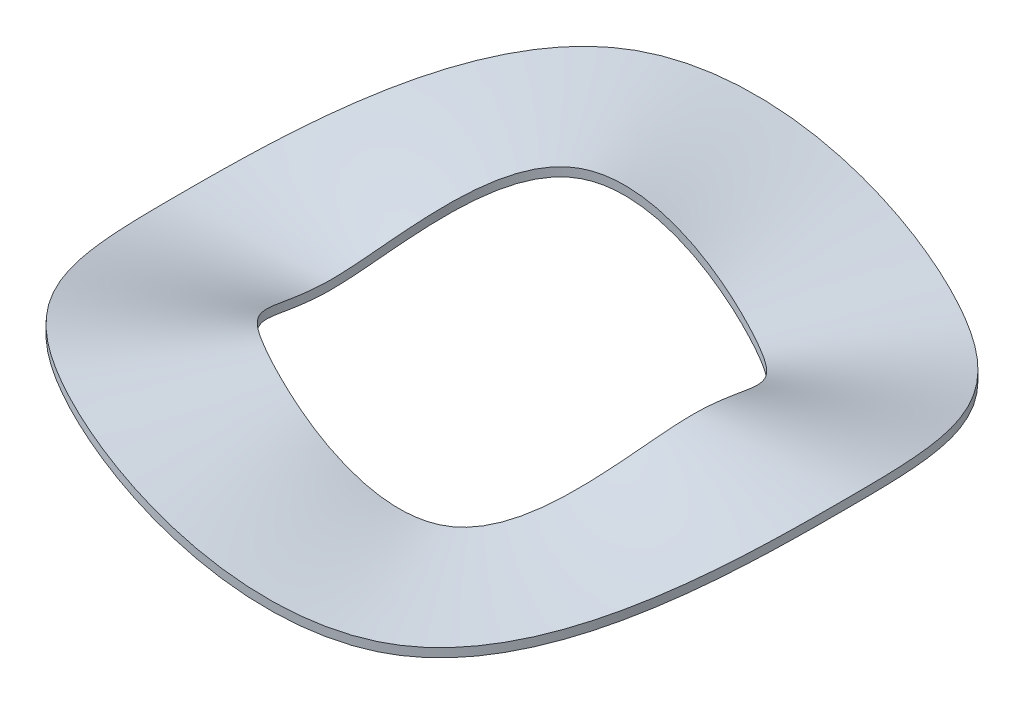
ISO-10303-21;
HEADER;
FILE_DESCRIPTION(('STEP AP214'),'2;1');
FILE_NAME('part.step','',(''),(''),'','','');
FILE_SCHEMA(('AUTOMOTIVE_DESIGN { 1 0 10303 214 1 1 1 1 }'));
ENDSEC;
DATA;
#1=APPLICATION_CONTEXT('core data for automotive mechanical design processes');
#2=APPLICATION_PROTOCOL_DEFINITION('international standard','automotive_design',2000,#1);
#3=PRODUCT_CONTEXT('',#1,'mechanical');
#4=PRODUCT('Part','Part','',(#3));
#5=PRODUCT_RELATED_PRODUCT_CATEGORY('part','',(#4));
#6=PRODUCT_DEFINITION_FORMATION('','',#4);
#7=PRODUCT_DEFINITION_CONTEXT('part definition',#1,'design');
#8=PRODUCT_DEFINITION('design','',#6,#7);
#9=PRODUCT_DEFINITION_SHAPE('','',#8);
#10=(LENGTH_UNIT() NAMED_UNIT(*) SI_UNIT(.MILLI.,.METRE.));
#11=(NAMED_UNIT(*) PLANE_ANGLE_UNIT() SI_UNIT($,.RADIAN.));
#12=(NAMED_UNIT(*) SI_UNIT($,.STERADIAN.) SOLID_ANGLE_UNIT());
#13=UNCERTAINTY_MEASURE_WITH_UNIT(LENGTH_MEASURE(1.E-05),#10,'distance_accuracy_value','');
#14=(GEOMETRIC_REPRESENTATION_CONTEXT(3) GLOBAL_UNCERTAINTY_ASSIGNED_CONTEXT((#13)) GLOBAL_UNIT_ASSIGNED_CONTEXT((#10,
#11,#12)) REPRESENTATION_CONTEXT('',''));
#15=CARTESIAN_POINT('',(0.,0.,0.));
#16=DIRECTION('',(0.,0.,1.));
#17=DIRECTION('',(1.,0.,0.));
#18=AXIS2_PLACEMENT_3D('',#15,#16,#17);
#19=CARTESIAN_POINT('',(-4.7625,0.127,0.));
#20=CARTESIAN_POINT('',(-4.76250000000064,0.127000000000109,-0.0824889197101102));
#21=CARTESIAN_POINT('',(-4.75773750000184,0.1315720000003,-0.247466759130352));
#22=CARTESIAN_POINT('',(-4.73666343750347,0.15077440000051,-0.494314851362952));
#23=CARTESIAN_POINT('',(-4.70201625000492,0.180949600000651,-0.739925609799963));
#24=CARTESIAN_POINT('',(-4.41483750001165,0.419608000001919,-2.20245415626632));
#25=CARTESIAN_POINT('',(-2.47650000000634,1.77292000000034,-4.94933518262082));
#26=CARTESIAN_POINT('',(2.85749999997695,-0.787399999999908,-4.94933518262991));
#27=CARTESIAN_POINT('',(5.7150000000307,1.95579999998627,-5.46359358037825E-11));
#28=CARTESIAN_POINT('',(2.85749999984022,-0.787400000002771,4.94933518271295));
#29=CARTESIAN_POINT('',(-2.47649999992121,1.77292000001231,4.94933518265687));
#30=CARTESIAN_POINT('',(-4.41483749998004,0.419607999995685,2.20245415625955));
#31=CARTESIAN_POINT('',(-4.70201624999364,0.180949599998723,0.73992560979949));
#32=CARTESIAN_POINT('',(-4.73666343749587,0.150774399999208,0.494314851362734));
#33=CARTESIAN_POINT('',(-4.75773749999802,0.131571999999644,0.247466759130307));
#34=CARTESIAN_POINT('',(-4.76249999999936,0.126999999999891,0.0824889197101086));
#35=CARTESIAN_POINT('',(-4.7625,0.127,0.));
#36=CARTESIAN_POINT('',(-4.04283333333333,0.127,0.));
#37=CARTESIAN_POINT('',(-4.04283333333387,0.127000000000109,-0.0700239273983604));
#38=CARTESIAN_POINT('',(-4.03879050000157,0.1315720000003,-0.210071782195099));
#39=CARTESIAN_POINT('',(-4.02090096250294,0.15077440000051,-0.419618384934773));
#40=CARTESIAN_POINT('',(-3.99148935000417,0.180949600000651,-0.628114628763524));
#41=CARTESIAN_POINT('',(-3.74770650000989,0.419608000001919,-1.86963886154163));
#42=CARTESIAN_POINT('',(-2.10227333333872,1.77292000000034,-4.20143564391368));
#43=CARTESIAN_POINT('',(2.42569999998044,-0.787399999999908,-4.20143564392139));
#44=CARTESIAN_POINT('',(4.85140000002606,1.95579999998627,-4.63798074110729E-11));
#45=CARTESIAN_POINT('',(2.42569999986436,-0.787400000002771,4.20143564399188));
#46=CARTESIAN_POINT('',(-2.10227333326645,1.77292000001231,4.20143564394428));
#47=CARTESIAN_POINT('',(-3.74770649998306,0.419607999995685,1.86963886153589));
#48=CARTESIAN_POINT('',(-3.9914893499946,0.180949599998723,0.628114628763123));
#49=CARTESIAN_POINT('',(-4.02090096249649,0.150774399999208,0.419618384934587));
#50=CARTESIAN_POINT('',(-4.03879049999832,0.131571999999644,0.21007178219506));
#51=CARTESIAN_POINT('',(-4.04283333333279,0.126999999999891,0.0700239273983587));
#52=CARTESIAN_POINT('',(-4.04283333333333,0.127,0.));
#53=CARTESIAN_POINT('',(-3.32316666666667,0.127,0.));
#54=CARTESIAN_POINT('',(-3.32316666666711,0.127000000000109,-0.0575589350866104));
#55=CARTESIAN_POINT('',(-3.31984350000129,0.1315720000003,-0.172676805259846));
#56=CARTESIAN_POINT('',(-3.30513848750242,0.15077440000051,-0.344921918506593));
#57=CARTESIAN_POINT('',(-3.28096245000343,0.180949600000651,-0.516303647727085));
#58=CARTESIAN_POINT('',(-3.08057550000813,0.419608000001919,-1.53682356681694));
#59=CARTESIAN_POINT('',(-1.72804666667109,1.77292000000034,-3.45353610520653));
#60=CARTESIAN_POINT('',(1.99389999998392,-0.787399999999908,-3.45353610521287));
#61=CARTESIAN_POINT('',(3.98780000002142,1.95579999998627,-3.81233605339752E-11));
#62=CARTESIAN_POINT('',(1.99389999988851,-0.787400000002771,3.45353610527082));
#63=CARTESIAN_POINT('',(-1.72804666661169,1.77292000001231,3.45353610523168));
#64=CARTESIAN_POINT('',(-3.08057549998608,0.419607999995685,1.53682356681222));
#65=CARTESIAN_POINT('',(-3.28096244999556,0.180949599998723,0.516303647726755));
#66=CARTESIAN_POINT('',(-3.30513848749712,0.150774399999208,0.344921918506441));
#67=CARTESIAN_POINT('',(-3.31984349999862,0.131571999999644,0.172676805259814));
#68=CARTESIAN_POINT('',(-3.32316666666622,0.126999999999891,0.057558935086609));
#69=CARTESIAN_POINT('',(-3.32316666666667,0.127,0.));
#70=CARTESIAN_POINT('',(-2.6035,0.127,0.));
#71=CARTESIAN_POINT('',(-2.60350000000035,0.127000000000109,-0.0450939427748603));
#72=CARTESIAN_POINT('',(-2.60089650000101,0.1315720000003,-0.135281828324592));
#73=CARTESIAN_POINT('',(-2.5893760125019,0.15077440000051,-0.270225452078414));
#74=CARTESIAN_POINT('',(-2.57043555000269,0.180949600000651,-0.404492666690646));
#75=CARTESIAN_POINT('',(-2.41344450000637,0.419608000001919,-1.20400827209225));
#76=CARTESIAN_POINT('',(-1.35382000000347,1.77292000000034,-2.70563656649938));
#77=CARTESIAN_POINT('',(1.5620999999874,-0.787399999999908,-2.70563656650435));
#78=CARTESIAN_POINT('',(3.12420000001678,1.95579999998626,-2.98675743425764E-11));
#79=CARTESIAN_POINT('',(1.56209999991265,-0.787400000002771,2.70563656654975));
#80=CARTESIAN_POINT('',(-1.35381999995693,1.77292000001231,2.70563656651909));
#81=CARTESIAN_POINT('',(-2.41344449998909,0.419607999995685,1.20400827208856));
#82=CARTESIAN_POINT('',(-2.57043554999652,0.180949599998723,0.404492666690388));
#83=CARTESIAN_POINT('',(-2.58937601249774,0.150774399999208,0.270225452078294));
#84=CARTESIAN_POINT('',(-2.60089649999892,0.131571999999644,0.135281828324568));
#85=CARTESIAN_POINT('',(-2.60349999999965,0.126999999999891,0.0450939427748593));
#86=CARTESIAN_POINT('',(-2.6035,0.127,0.));
#87=B_SPLINE_SURFACE_WITH_KNOTS('',3,3,((#19,#20,#21,#22,#23,#24,#25,#26,#27,#28,#29,#30,#31,
#32,#33,#34,#35),(#36,#37,#38,#39,#40,#41,#42,#43,#44,#45,#46,#47,#48,#49,#50,#51,#52),(#53,#54,
#55,#56,#57,#58,#59,#60,#61,#62,#63,#64,#65,#66,#67,#68,#69),(#70,#71,#72,#73,#74,#75,#76,#77,
#78,#79,#80,#81,#82,#83,#84,#85,#86)),.UNSPECIFIED.,.F.,.T.,.F.,(4,4),(4,1,1,1,1,1,1,1,1,1,1,1,
1,1,4),(0.,1.),(0.,0.0083333333333333,0.0166666666666666,0.0250000000000001,0.0333333333333334,
0.166666666667159,0.333333333333334,0.499999999998881,0.666666666661151,0.833333333333296,
0.966666666666667,0.975,0.983333333333333,0.991666666666667,1.),.UNSPECIFIED.);
#88=CARTESIAN_POINT('',(-4.7625,0.127,0.));
#89=CARTESIAN_POINT('',(-4.76250000000064,0.127000000000109,-0.0824889197101102));
#90=CARTESIAN_POINT('',(-4.75773750000184,0.1315720000003,-0.247466759130352));
#91=CARTESIAN_POINT('',(-4.73666343750347,0.15077440000051,-0.494314851362952));
#92=CARTESIAN_POINT('',(-4.70201625000492,0.180949600000651,-0.739925609799963));
#93=CARTESIAN_POINT('',(-4.41483750001165,0.419608000001919,-2.20245415626632));
#94=CARTESIAN_POINT('',(-2.47650000000634,1.77292000000034,-4.94933518262082));
#95=CARTESIAN_POINT('',(2.85749999997695,-0.787399999999908,-4.94933518262991));
#96=CARTESIAN_POINT('',(5.7150000000307,1.95579999998627,-5.46359358037825E-11));
#97=CARTESIAN_POINT('',(2.85749999984022,-0.787400000002771,4.94933518271295));
#98=CARTESIAN_POINT('',(-2.47649999992121,1.77292000001231,4.94933518265687));
#99=CARTESIAN_POINT('',(-4.41483749998004,0.419607999995685,2.20245415625955));
#100=CARTESIAN_POINT('',(-4.70201624999364,0.180949599998723,0.73992560979949));
#101=CARTESIAN_POINT('',(-4.73666343749587,0.150774399999208,0.494314851362734));
#102=CARTESIAN_POINT('',(-4.75773749999802,0.131571999999644,0.247466759130307));
#103=CARTESIAN_POINT('',(-4.76249999999936,0.126999999999891,0.0824889197101086));
#104=CARTESIAN_POINT('',(-4.7625,0.127,0.));
#105=B_SPLINE_CURVE_WITH_KNOTS('',3,(#88,#89,#90,#91,#92,#93,#94,#95,#96,#97,#98,#99,#100,#101,
#102,#103,#104),.UNSPECIFIED.,.T.,.F.,(4,1,1,1,1,1,1,1,1,1,1,1,1,1,4),(0.,0.0083333333333333,
0.0166666666666666,0.0250000000000001,0.0333333333333334,0.166666666667159,0.333333333333334,
0.499999999998881,0.666666666661151,0.833333333333296,0.966666666666667,0.975,0.983333333333333,
0.991666666666667,1.),.UNSPECIFIED.);
#106=CARTESIAN_POINT('',(-4.7625,0.127,0.));
#107=VERTEX_POINT('',#106);
#108=EDGE_CURVE('E11',#107,#107,#105,.F.);
#109=CARTESIAN_POINT('',(-2.6035,0.127,0.));
#110=CARTESIAN_POINT('',(-2.60350000000035,0.127000000000109,-0.0450939427748603));
#111=CARTESIAN_POINT('',(-2.60089650000101,0.1315720000003,-0.135281828324592));
#112=CARTESIAN_POINT('',(-2.5893760125019,0.15077440000051,-0.270225452078414));
#113=CARTESIAN_POINT('',(-2.57043555000269,0.180949600000651,-0.404492666690646));
#114=CARTESIAN_POINT('',(-2.41344450000637,0.419608000001919,-1.20400827209225));
#115=CARTESIAN_POINT('',(-1.35382000000347,1.77292000000034,-2.70563656649938));
#116=CARTESIAN_POINT('',(1.5620999999874,-0.787399999999908,-2.70563656650435));
#117=CARTESIAN_POINT('',(3.12420000001678,1.95579999998626,-2.98675743425764E-11));
#118=CARTESIAN_POINT('',(1.56209999991265,-0.787400000002771,2.70563656654975));
#119=CARTESIAN_POINT('',(-1.35381999995693,1.77292000001231,2.70563656651909));
#120=CARTESIAN_POINT('',(-2.41344449998909,0.419607999995685,1.20400827208856));
#121=CARTESIAN_POINT('',(-2.57043554999652,0.180949599998723,0.404492666690388));
#122=CARTESIAN_POINT('',(-2.58937601249774,0.150774399999208,0.270225452078294));
#123=CARTESIAN_POINT('',(-2.60089649999892,0.131571999999644,0.135281828324568));
#124=CARTESIAN_POINT('',(-2.60349999999965,0.126999999999891,0.0450939427748593));
#125=CARTESIAN_POINT('',(-2.6035,0.127,0.));
#126=B_SPLINE_CURVE_WITH_KNOTS('',3,(#109,#110,#111,#112,#113,#114,#115,#116,#117,#118,#119,
#120,#121,#122,#123,#124,#125),.UNSPECIFIED.,.T.,.F.,(4,1,1,1,1,1,1,1,1,1,1,1,1,1,4),(0.,
0.0083333333333333,0.0166666666666666,0.0250000000000001,0.0333333333333334,0.166666666667159,
0.333333333333334,0.499999999998881,0.666666666661151,0.833333333333296,0.966666666666667,0.975,
0.983333333333333,0.991666666666667,1.),.UNSPECIFIED.);
#127=CARTESIAN_POINT('',(-2.6035,0.127,0.));
#128=VERTEX_POINT('',#127);
#129=EDGE_CURVE('E60',#128,#128,#126,.T.);
#130=ORIENTED_EDGE('',*,*,#108,.T.);
#131=EDGE_LOOP('',(#130));
#132=FACE_BOUND('',#131,.T.);
#133=ORIENTED_EDGE('',*,*,#129,.T.);
#134=EDGE_LOOP('',(#133));
#135=FACE_BOUND('',#134,.T.);
#136=ADVANCED_FACE('F48',(#132,#135),#87,.T.);
#137=CARTESIAN_POINT('',(-4.7625,0.,0.));
#138=CARTESIAN_POINT('',(-4.76250000000064,1.09425433598704E-13,-0.0824889197101102));
#139=CARTESIAN_POINT('',(-4.75773750000184,0.00457200000030009,-0.247466759130352));
#140=CARTESIAN_POINT('',(-4.73666343750347,0.0237744000005098,-0.494314851362952));
#141=CARTESIAN_POINT('',(-4.70201625000492,0.0539496000006514,-0.739925609799963));
#142=CARTESIAN_POINT('',(-4.41483750001165,0.292608000001919,-2.20245415626632));
#143=CARTESIAN_POINT('',(-2.47650000000634,1.64592000000034,-4.94933518262082));
#144=CARTESIAN_POINT('',(2.85749999997695,-0.914399999999908,-4.94933518262991));
#145=CARTESIAN_POINT('',(5.7150000000307,1.82879999998627,-5.46359358037825E-11));
#146=CARTESIAN_POINT('',(2.85749999984022,-0.91440000000277,4.94933518271295));
#147=CARTESIAN_POINT('',(-2.47649999992121,1.64592000001231,4.94933518265687));
#148=CARTESIAN_POINT('',(-4.41483749998004,0.292607999995685,2.20245415625955));
#149=CARTESIAN_POINT('',(-4.70201624999364,0.0539495999987229,0.73992560979949));
#150=CARTESIAN_POINT('',(-4.73666343749587,0.023774399999208,0.494314851362734));
#151=CARTESIAN_POINT('',(-4.75773749999802,0.00457199999964435,0.247466759130307));
#152=CARTESIAN_POINT('',(-4.76249999999936,-1.09157135912662E-13,0.0824889197101087));
#153=CARTESIAN_POINT('',(-4.7625,0.,0.));
#154=CARTESIAN_POINT('',(-4.7625,0.0105833333333333,0.));
#155=CARTESIAN_POINT('',(-4.76250000000064,0.0105833333334426,-0.0824889197101102));
#156=CARTESIAN_POINT('',(-4.75773750000184,0.0151553333336333,-0.247466759130352));
#157=CARTESIAN_POINT('',(-4.73666343750347,0.034357733333843,-0.494314851362952));
#158=CARTESIAN_POINT('',(-4.70201625000492,0.0645329333339845,-0.739925609799963));
#159=CARTESIAN_POINT('',(-4.41483750001165,0.303191333335252,-2.20245415626632));
#160=CARTESIAN_POINT('',(-2.47650000000634,1.65650333333367,-4.94933518262082));
#161=CARTESIAN_POINT('',(2.85749999997695,-0.903816666666575,-4.94933518262991));
#162=CARTESIAN_POINT('',(5.7150000000307,1.8393833333196,-5.46359358037825E-11));
#163=CARTESIAN_POINT('',(2.85749999984021,-0.903816666669437,4.94933518271295));
#164=CARTESIAN_POINT('',(-2.47649999992121,1.65650333334564,4.94933518265687));
#165=CARTESIAN_POINT('',(-4.41483749998004,0.303191333329018,2.20245415625955));
#166=CARTESIAN_POINT('',(-4.70201624999364,0.0645329333320561,0.73992560979949));
#167=CARTESIAN_POINT('',(-4.73666343749587,0.0343577333325412,0.494314851362734));
#168=CARTESIAN_POINT('',(-4.75773749999802,0.0151553333329776,0.247466759130307));
#169=CARTESIAN_POINT('',(-4.76249999999936,0.010583333333224,0.0824889197101087));
#170=CARTESIAN_POINT('',(-4.7625,0.0105833333333333,0.));
#171=CARTESIAN_POINT('',(-4.7625,0.0317500000000001,0.));
#172=CARTESIAN_POINT('',(-4.76250000000064,0.0317500000001094,-0.0824889197101102));
#173=CARTESIAN_POINT('',(-4.75773750000185,0.0363220000003001,-0.247466759130352));
#174=CARTESIAN_POINT('',(-4.73666343750347,0.0555244000005098,-0.494314851362952));
#175=CARTESIAN_POINT('',(-4.70201625000492,0.0856996000006514,-0.739925609799963));
#176=CARTESIAN_POINT('',(-4.41483750001165,0.324358000001919,-2.20245415626632));
#177=CARTESIAN_POINT('',(-2.47650000000634,1.67767000000034,-4.94933518262082));
#178=CARTESIAN_POINT('',(2.85749999997695,-0.882649999999909,-4.94933518262992));
#179=CARTESIAN_POINT('',(5.71500000003071,1.86054999998627,-5.46339029247091E-11));
#180=CARTESIAN_POINT('',(2.85749999984022,-0.882650000002771,4.94933518271295));
#181=CARTESIAN_POINT('',(-2.47649999992121,1.67767000001231,4.94933518265688));
#182=CARTESIAN_POINT('',(-4.41483749998005,0.324357999995684,2.20245415625956));
#183=CARTESIAN_POINT('',(-4.70201624999364,0.0856995999987229,0.739925609799491));
#184=CARTESIAN_POINT('',(-4.73666343749587,0.055524399999208,0.494314851362734));
#185=CARTESIAN_POINT('',(-4.75773749999802,0.0363219999996443,0.247466759130307));
#186=CARTESIAN_POINT('',(-4.76249999999937,0.0317499999998908,0.0824889197101087));
#187=CARTESIAN_POINT('',(-4.7625,0.0317500000000001,0.));
#188=CARTESIAN_POINT('',(-4.7625,0.0635000000000002,0.));
#189=CARTESIAN_POINT('',(-4.76250000000064,0.0635000000001095,-0.0824889197101104));
#190=CARTESIAN_POINT('',(-4.75773750000184,0.0680720000003001,-0.247466759130352));
#191=CARTESIAN_POINT('',(-4.73666343750347,0.0872744000005098,-0.494314851362952));
#192=CARTESIAN_POINT('',(-4.70201625000491,0.117449600000651,-0.739925609799963));
#193=CARTESIAN_POINT('',(-4.41483750001165,0.356108000001918,-2.20245415626632));
#194=CARTESIAN_POINT('',(-2.47650000000633,1.70942000000034,-4.94933518262083));
#195=CARTESIAN_POINT('',(2.85749999997695,-0.850899999999908,-4.94933518262991));
#196=CARTESIAN_POINT('',(5.71500000003071,1.89229999998626,-5.46381245369182E-11));
#197=CARTESIAN_POINT('',(2.85749999984021,-0.85090000000277,4.94933518271296));
#198=CARTESIAN_POINT('',(-2.47649999992121,1.70942000001231,4.94933518265687));
#199=CARTESIAN_POINT('',(-4.41483749998005,0.356107999995685,2.20245415625955));
#200=CARTESIAN_POINT('',(-4.70201624999364,0.117449599998723,0.73992560979949));
#201=CARTESIAN_POINT('',(-4.73666343749587,0.0872743999992082,0.494314851362733));
#202=CARTESIAN_POINT('',(-4.75773749999802,0.0680719999996444,0.247466759130307));
#203=CARTESIAN_POINT('',(-4.76249999999936,0.0634999999998909,0.0824889197101085));
#204=CARTESIAN_POINT('',(-4.7625,0.0635000000000002,0.));
#205=CARTESIAN_POINT('',(-4.7625,0.0952500000000001,0.));
#206=CARTESIAN_POINT('',(-4.76250000000064,0.0952500000001094,-0.0824889197101102));
#207=CARTESIAN_POINT('',(-4.75773750000184,0.0998220000003,-0.247466759130352));
#208=CARTESIAN_POINT('',(-4.73666343750347,0.11902440000051,-0.494314851362952));
#209=CARTESIAN_POINT('',(-4.70201625000492,0.149199600000651,-0.739925609799963));
#210=CARTESIAN_POINT('',(-4.41483750001165,0.387858000001919,-2.20245415626632));
#211=CARTESIAN_POINT('',(-2.47650000000635,1.74117000000034,-4.94933518262082));
#212=CARTESIAN_POINT('',(2.85749999997696,-0.819149999999908,-4.94933518262992));
#213=CARTESIAN_POINT('',(5.7150000000307,1.92404999998627,-5.46335573352666E-11));
#214=CARTESIAN_POINT('',(2.85749999984022,-0.81915000000277,4.94933518271295));
#215=CARTESIAN_POINT('',(-2.47649999992121,1.7411700000123,4.94933518265688));
#216=CARTESIAN_POINT('',(-4.41483749998004,0.387857999995684,2.20245415625956));
#217=CARTESIAN_POINT('',(-4.70201624999364,0.149199599998723,0.739925609799491));
#218=CARTESIAN_POINT('',(-4.73666343749587,0.119024399999208,0.494314851362734));
#219=CARTESIAN_POINT('',(-4.75773749999802,0.0998219999996443,0.247466759130307));
#220=CARTESIAN_POINT('',(-4.76249999999936,0.0952499999998908,0.0824889197101087));
#221=CARTESIAN_POINT('',(-4.7625,0.0952500000000001,0.));
#222=CARTESIAN_POINT('',(-4.7625,0.116416666666667,0.));
#223=CARTESIAN_POINT('',(-4.76250000000064,0.116416666666776,-0.0824889197101102));
#224=CARTESIAN_POINT('',(-4.75773750000184,0.120988666666967,-0.247466759130352));
#225=CARTESIAN_POINT('',(-4.73666343750347,0.140191066667176,-0.494314851362952));
#226=CARTESIAN_POINT('',(-4.70201625000492,0.170366266667318,-0.739925609799963));
#227=CARTESIAN_POINT('',(-4.41483750001165,0.409024666668585,-2.20245415626632));
#228=CARTESIAN_POINT('',(-2.47650000000634,1.762336666667,-4.94933518262082));
#229=CARTESIAN_POINT('',(2.85749999997695,-0.797983333333241,-4.94933518262991));
#230=CARTESIAN_POINT('',(5.7150000000307,1.94521666665293,-5.46359358037825E-11));
#231=CARTESIAN_POINT('',(2.85749999984021,-0.797983333336104,4.94933518271295));
#232=CARTESIAN_POINT('',(-2.47649999992121,1.76233666667897,4.94933518265687));
#233=CARTESIAN_POINT('',(-4.41483749998004,0.409024666662351,2.20245415625955));
#234=CARTESIAN_POINT('',(-4.70201624999364,0.17036626666539,0.73992560979949));
#235=CARTESIAN_POINT('',(-4.73666343749587,0.140191066665875,0.494314851362734));
#236=CARTESIAN_POINT('',(-4.75773749999802,0.120988666666311,0.247466759130307));
#237=CARTESIAN_POINT('',(-4.76249999999936,0.116416666666558,0.0824889197101086));
#238=CARTESIAN_POINT('',(-4.7625,0.116416666666667,0.));
#239=CARTESIAN_POINT('',(-4.7625,0.127,0.));
#240=CARTESIAN_POINT('',(-4.76250000000064,0.127000000000109,-0.0824889197101102));
#241=CARTESIAN_POINT('',(-4.75773750000184,0.1315720000003,-0.247466759130352));
#242=CARTESIAN_POINT('',(-4.73666343750347,0.15077440000051,-0.494314851362952));
#243=CARTESIAN_POINT('',(-4.70201625000492,0.180949600000651,-0.739925609799963));
#244=CARTESIAN_POINT('',(-4.41483750001165,0.419608000001919,-2.20245415626632));
#245=CARTESIAN_POINT('',(-2.47650000000634,1.77292000000034,-4.94933518262082));
#246=CARTESIAN_POINT('',(2.85749999997696,-0.787399999999908,-4.94933518262991));
#247=CARTESIAN_POINT('',(5.7150000000307,1.95579999998627,-5.46359358037825E-11));
#248=CARTESIAN_POINT('',(2.85749999984022,-0.787400000002771,4.94933518271295));
#249=CARTESIAN_POINT('',(-2.47649999992121,1.77292000001231,4.94933518265687));
#250=CARTESIAN_POINT('',(-4.41483749998004,0.419607999995685,2.20245415625955));
#251=CARTESIAN_POINT('',(-4.70201624999364,0.180949599998723,0.73992560979949));
#252=CARTESIAN_POINT('',(-4.73666343749587,0.150774399999208,0.494314851362734));
#253=CARTESIAN_POINT('',(-4.75773749999802,0.131571999999644,0.247466759130307));
#254=CARTESIAN_POINT('',(-4.76249999999936,0.126999999999891,0.0824889197101086));
#255=CARTESIAN_POINT('',(-4.7625,0.127,0.));
#256=B_SPLINE_SURFACE_WITH_KNOTS('',3,3,((#137,#138,#139,#140,#141,#142,#143,#144,#145,#146,
#147,#148,#149,#150,#151,#152,#153),(#154,#155,#156,#157,#158,#159,#160,#161,#162,#163,#164,
#165,#166,#167,#168,#169,#170),(#171,#172,#173,#174,#175,#176,#177,#178,#179,#180,#181,#182,
#183,#184,#185,#186,#187),(#188,#189,#190,#191,#192,#193,#194,#195,#196,#197,#198,#199,#200,
#201,#202,#203,#204),(#205,#206,#207,#208,#209,#210,#211,#212,#213,#214,#215,#216,#217,#218,
#219,#220,#221),(#222,#223,#224,#225,#226,#227,#228,#229,#230,#231,#232,#233,#234,#235,#236,
#237,#238),(#239,#240,#241,#242,#243,#244,#245,#246,#247,#248,#249,#250,#251,#252,#253,#254,
#255)),.UNSPECIFIED.,.F.,.T.,.F.,(4,1,1,1,4),(4,1,1,1,1,1,1,1,1,1,1,1,1,1,4),(0.947368421052631,
0.960526315789473,0.973684210526316,0.986842105263158,1.),(0.,0.0083333333333333,
0.0166666666666666,0.0250000000000001,0.0333333333333334,0.166666666667159,0.333333333333334,
0.499999999998881,0.666666666661151,0.833333333333296,0.966666666666667,0.975,0.983333333333333,
0.991666666666667,1.),.UNSPECIFIED.);
#257=CARTESIAN_POINT('',(-4.7625,0.,0.));
#258=CARTESIAN_POINT('',(-4.76250000000064,1.09425433598704E-13,-0.0824889197101102));
#259=CARTESIAN_POINT('',(-4.75773750000184,0.00457200000030009,-0.247466759130352));
#260=CARTESIAN_POINT('',(-4.73666343750347,0.0237744000005098,-0.494314851362952));
#261=CARTESIAN_POINT('',(-4.70201625000492,0.0539496000006514,-0.739925609799963));
#262=CARTESIAN_POINT('',(-4.41483750001165,0.292608000001919,-2.20245415626632));
#263=CARTESIAN_POINT('',(-2.47650000000634,1.64592000000034,-4.94933518262082));
#264=CARTESIAN_POINT('',(2.85749999997695,-0.914399999999908,-4.94933518262991));
#265=CARTESIAN_POINT('',(5.7150000000307,1.82879999998627,-5.46359358037825E-11));
#266=CARTESIAN_POINT('',(2.85749999984022,-0.91440000000277,4.94933518271295));
#267=CARTESIAN_POINT('',(-2.47649999992121,1.64592000001231,4.94933518265687));
#268=CARTESIAN_POINT('',(-4.41483749998004,0.292607999995685,2.20245415625955));
#269=CARTESIAN_POINT('',(-4.70201624999364,0.0539495999987229,0.73992560979949));
#270=CARTESIAN_POINT('',(-4.73666343749587,0.023774399999208,0.494314851362734));
#271=CARTESIAN_POINT('',(-4.75773749999802,0.00457199999964435,0.247466759130307));
#272=CARTESIAN_POINT('',(-4.76249999999936,-1.09157135912662E-13,0.0824889197101087));
#273=CARTESIAN_POINT('',(-4.7625,0.,0.));
#274=B_SPLINE_CURVE_WITH_KNOTS('',3,(#257,#258,#259,#260,#261,#262,#263,#264,#265,#266,#267,
#268,#269,#270,#271,#272,#273),.UNSPECIFIED.,.T.,.F.,(4,1,1,1,1,1,1,1,1,1,1,1,1,1,4),(0.,
0.0083333333333333,0.0166666666666666,0.0250000000000001,0.0333333333333334,0.166666666667159,
0.333333333333334,0.499999999998881,0.666666666661151,0.833333333333296,0.966666666666667,0.975,
0.983333333333333,0.991666666666667,1.),.UNSPECIFIED.);
#275=CARTESIAN_POINT('',(-4.7625,0.,0.));
#276=VERTEX_POINT('',#275);
#277=EDGE_CURVE('E54',#276,#276,#274,.T.);
#278=ORIENTED_EDGE('',*,*,#108,.F.);
#279=EDGE_LOOP('',(#278));
#280=FACE_BOUND('',#279,.T.);
#281=ORIENTED_EDGE('',*,*,#277,.F.);
#282=EDGE_LOOP('',(#281));
#283=FACE_BOUND('',#282,.T.);
#284=ADVANCED_FACE('F50',(#280,#283),#256,.T.);
#285=CARTESIAN_POINT('',(-2.6035,0.,0.));
#286=CARTESIAN_POINT('',(-2.60350000000035,1.09317225139693E-13,-0.0450939427748603));
#287=CARTESIAN_POINT('',(-2.60089650000101,0.00457200000029997,-0.135281828324592));
#288=CARTESIAN_POINT('',(-2.5893760125019,0.0237744000005097,-0.270225452078414));
#289=CARTESIAN_POINT('',(-2.57043555000269,0.0539496000006512,-0.404492666690646));
#290=CARTESIAN_POINT('',(-2.41344450000637,0.292608000001919,-1.20400827209225));
#291=CARTESIAN_POINT('',(-1.35382000000347,1.64592000000034,-2.70563656649938));
#292=CARTESIAN_POINT('',(1.5620999999874,-0.914399999999908,-2.70563656650435));
#293=CARTESIAN_POINT('',(3.12420000001678,1.82879999998627,-2.98674828630181E-11));
#294=CARTESIAN_POINT('',(1.56209999991265,-0.91440000000277,2.70563656654975));
#295=CARTESIAN_POINT('',(-1.35381999995693,1.64592000001231,2.70563656651909));
#296=CARTESIAN_POINT('',(-2.41344449998909,0.292607999995685,1.20400827208856));
#297=CARTESIAN_POINT('',(-2.57043554999652,0.0539495999987228,0.404492666690388));
#298=CARTESIAN_POINT('',(-2.58937601249774,0.023774399999208,0.270225452078294));
#299=CARTESIAN_POINT('',(-2.60089649999892,0.00457199999964426,0.135281828324568));
#300=CARTESIAN_POINT('',(-2.60349999999965,-1.09254756459833E-13,0.0450939427748593));
#301=CARTESIAN_POINT('',(-2.6035,0.,0.));
#302=CARTESIAN_POINT('',(-2.78341666666667,0.,0.));
#303=CARTESIAN_POINT('',(-2.78341666666704,1.09317225139693E-13,-0.0482101908527978));
#304=CARTESIAN_POINT('',(-2.78063325000108,0.00457200000029997,-0.144630572558406));
#305=CARTESIAN_POINT('',(-2.76831663125203,0.0237744000005097,-0.288899568685458));
#306=CARTESIAN_POINT('',(-2.74806727500287,0.0539496000006512,-0.432445411949756));
#307=CARTESIAN_POINT('',(-2.58022725000681,0.292608000001919,-1.28721209577343));
#308=CARTESIAN_POINT('',(-1.44737666667037,1.64592000000034,-2.89261145117617));
#309=CARTESIAN_POINT('',(1.67004999998653,-0.914399999999908,-2.89261145118148));
#310=CARTESIAN_POINT('',(3.34010000001794,1.82879999998627,-3.19318783383298E-11));
#311=CARTESIAN_POINT('',(1.67004999990661,-0.91440000000277,2.89261145123001));
#312=CARTESIAN_POINT('',(-1.44737666662062,1.64592000001231,2.89261145119724));
#313=CARTESIAN_POINT('',(-2.58022724998834,0.292607999995685,1.28721209576947));
#314=CARTESIAN_POINT('',(-2.74806727499628,0.0539495999987228,0.43244541194948));
#315=CARTESIAN_POINT('',(-2.76831663124758,0.023774399999208,0.288899568685331));
#316=CARTESIAN_POINT('',(-2.78063324999884,0.00457199999964426,0.144630572558379));
#317=CARTESIAN_POINT('',(-2.78341666666629,-1.09254756459833E-13,0.0482101908527967));
#318=CARTESIAN_POINT('',(-2.78341666666667,0.,0.));
#319=CARTESIAN_POINT('',(-3.14325,0.,0.));
#320=CARTESIAN_POINT('',(-3.14325000000042,1.09259626899279E-13,-0.0544426870086729));
#321=CARTESIAN_POINT('',(-3.14010675000122,0.00457200000029989,-0.163328061026032));
#322=CARTESIAN_POINT('',(-3.12619786875229,0.0237744000005096,-0.326247801899548));
#323=CARTESIAN_POINT('',(-3.10333072500324,0.0539496000006511,-0.488350902467976));
#324=CARTESIAN_POINT('',(-2.91379275000769,0.292608000001918,-1.45361974313577));
#325=CARTESIAN_POINT('',(-1.63449000000419,1.64592000000034,-3.26656122052974));
#326=CARTESIAN_POINT('',(1.88594999998479,-0.914399999999908,-3.26656122053574));
#327=CARTESIAN_POINT('',(3.77190000002026,1.82879999998626,-3.60593817988735E-11));
#328=CARTESIAN_POINT('',(1.88594999989455,-0.91440000000277,3.26656122059055));
#329=CARTESIAN_POINT('',(-1.634489999948,1.6459200000123,3.26656122055354));
#330=CARTESIAN_POINT('',(-2.91379274998683,0.292607999995685,1.45361974313131));
#331=CARTESIAN_POINT('',(-3.1033307249958,0.0539495999987228,0.488350902467663));
#332=CARTESIAN_POINT('',(-3.12619786874727,0.0237743999992079,0.326247801899404));
#333=CARTESIAN_POINT('',(-3.14010674999869,0.00457199999964423,0.163328061026002));
#334=CARTESIAN_POINT('',(-3.14324999999958,-1.09298590414853E-13,0.0544426870086715));
#335=CARTESIAN_POINT('',(-3.14325,0.,0.));
#336=CARTESIAN_POINT('',(-3.683,0.,0.));
#337=CARTESIAN_POINT('',(-3.68300000000049,1.09369529424186E-13,-0.0637914312424853));
#338=CARTESIAN_POINT('',(-3.67931700000143,0.00457200000030004,-0.191374293727472));
#339=CARTESIAN_POINT('',(-3.66301972500268,0.0237744000005098,-0.382270151720683));
#340=CARTESIAN_POINT('',(-3.6362259000038,0.0539496000006513,-0.572209138245305));
#341=CARTESIAN_POINT('',(-3.41414100000901,0.292608000001919,-1.70323121417929));
#342=CARTESIAN_POINT('',(-1.9151600000049,1.64592000000034,-3.8274858745601));
#343=CARTESIAN_POINT('',(2.20979999998218,-0.914399999999909,-3.82748587456713));
#344=CARTESIAN_POINT('',(4.41960000002375,1.82879999998627,-4.22523039505292E-11));
#345=CARTESIAN_POINT('',(2.20979999987643,-0.914400000002771,3.82748587463135));
#346=CARTESIAN_POINT('',(-1.91515999993907,1.64592000001231,3.82748587458798));
#347=CARTESIAN_POINT('',(-3.41414099998457,0.292607999995685,1.70323121417406));
#348=CARTESIAN_POINT('',(-3.63622589999508,0.0539495999987229,0.572209138244939));
#349=CARTESIAN_POINT('',(-3.66301972499681,0.023774399999208,0.382270151720514));
#350=CARTESIAN_POINT('',(-3.67931699999847,0.00457199999964429,0.191374293727437));
#351=CARTESIAN_POINT('',(-3.68299999999951,-1.09214734153075E-13,0.0637914312424838));
#352=CARTESIAN_POINT('',(-3.683,0.,0.));
#353=CARTESIAN_POINT('',(-4.22275,0.,0.));
#354=CARTESIAN_POINT('',(-4.22275000000056,1.094231042581E-13,-0.0731401754762977));
#355=CARTESIAN_POINT('',(-4.21852725000163,0.00457200000030007,-0.219420526428912));
#356=CARTESIAN_POINT('',(-4.19984158125307,0.0237744000005098,-0.438292501541817));
#357=CARTESIAN_POINT('',(-4.16912107500436,0.0539496000006513,-0.656067374022634));
#358=CARTESIAN_POINT('',(-3.91448925001033,0.292608000001919,-1.9528426852228));
#359=CARTESIAN_POINT('',(-2.19583000000563,1.64592000000034,-4.38841052859046));
#360=CARTESIAN_POINT('',(2.53364999997957,-0.914399999999907,-4.38841052859852));
#361=CARTESIAN_POINT('',(5.06730000002722,1.82879999998626,-4.84430543097082E-11));
#362=CARTESIAN_POINT('',(2.53364999985833,-0.914400000002769,4.38841052867215));
#363=CARTESIAN_POINT('',(-2.19582999993014,1.6459200000123,4.38841052862243));
#364=CARTESIAN_POINT('',(-3.9144892499823,0.292607999995684,1.95284268521681));
#365=CARTESIAN_POINT('',(-4.16912107499436,0.0539495999987229,0.656067374022215));
#366=CARTESIAN_POINT('',(-4.19984158124633,0.023774399999208,0.438292501541624));
#367=CARTESIAN_POINT('',(-4.21852724999824,0.00457199999964435,0.219420526428872));
#368=CARTESIAN_POINT('',(-4.22274999999943,-1.09152477231452E-13,0.0731401754762963));
#369=CARTESIAN_POINT('',(-4.22275,0.,0.));
#370=CARTESIAN_POINT('',(-4.58258333333333,0.,0.));
#371=CARTESIAN_POINT('',(-4.58258333333394,1.09317225139693E-13,-0.0793726716321728));
#372=CARTESIAN_POINT('',(-4.57800075000177,0.00457200000029997,-0.238118014896539));
#373=CARTESIAN_POINT('',(-4.55772281875334,0.0237744000005097,-0.475640734755907));
#374=CARTESIAN_POINT('',(-4.52438452500473,0.0539496000006512,-0.711972864540853));
#375=CARTESIAN_POINT('',(-4.24805475001121,0.292608000001919,-2.11925033258515));
#376=CARTESIAN_POINT('',(-2.38294333333943,1.64592000000034,-4.76236029794403));
#377=CARTESIAN_POINT('',(2.74954999997782,-0.914399999999908,-4.76236029795278));
#378=CARTESIAN_POINT('',(5.49910000002954,1.82879999998626,-5.2571648748688E-11));
#379=CARTESIAN_POINT('',(2.74954999984625,-0.91440000000277,4.76236029803268));
#380=CARTESIAN_POINT('',(-2.38294333325752,1.64592000001231,4.76236029797872));
#381=CARTESIAN_POINT('',(-4.2480547499808,0.292607999995684,2.11925033257864));
#382=CARTESIAN_POINT('',(-4.52438452499388,0.0539495999987228,0.711972864540398));
#383=CARTESIAN_POINT('',(-4.55772281874602,0.0237743999992079,0.475640734755697));
#384=CARTESIAN_POINT('',(-4.57800074999809,0.00457199999964426,0.238118014896495));
#385=CARTESIAN_POINT('',(-4.58258333333272,-1.09255391734543E-13,0.0793726716321711));
#386=CARTESIAN_POINT('',(-4.58258333333333,0.,0.));
#387=CARTESIAN_POINT('',(-4.7625,0.,0.));
#388=CARTESIAN_POINT('',(-4.76250000000064,1.09425433598704E-13,-0.0824889197101102));
#389=CARTESIAN_POINT('',(-4.75773750000184,0.00457200000030009,-0.247466759130352));
#390=CARTESIAN_POINT('',(-4.73666343750347,0.0237744000005098,-0.494314851362952));
#391=CARTESIAN_POINT('',(-4.70201625000492,0.0539496000006514,-0.739925609799963));
#392=CARTESIAN_POINT('',(-4.41483750001165,0.292608000001919,-2.20245415626632));
#393=CARTESIAN_POINT('',(-2.47650000000634,1.64592000000034,-4.94933518262082));
#394=CARTESIAN_POINT('',(2.85749999997695,-0.914399999999908,-4.94933518262991));
#395=CARTESIAN_POINT('',(5.7150000000307,1.82879999998627,-5.46359358037825E-11));
#396=CARTESIAN_POINT('',(2.85749999984022,-0.91440000000277,4.94933518271295));
#397=CARTESIAN_POINT('',(-2.47649999992121,1.64592000001231,4.94933518265687));
#398=CARTESIAN_POINT('',(-4.41483749998004,0.292607999995685,2.20245415625955));
#399=CARTESIAN_POINT('',(-4.70201624999364,0.0539495999987229,0.73992560979949));
#400=CARTESIAN_POINT('',(-4.73666343749587,0.023774399999208,0.494314851362734));
#401=CARTESIAN_POINT('',(-4.75773749999802,0.00457199999964435,0.247466759130307));
#402=CARTESIAN_POINT('',(-4.76249999999936,-1.09157135912662E-13,0.0824889197101087));
#403=CARTESIAN_POINT('',(-4.7625,0.,0.));
#404=B_SPLINE_SURFACE_WITH_KNOTS('',3,3,((#285,#286,#287,#288,#289,#290,#291,#292,#293,#294,
#295,#296,#297,#298,#299,#300,#301),(#302,#303,#304,#305,#306,#307,#308,#309,#310,#311,#312,
#313,#314,#315,#316,#317,#318),(#319,#320,#321,#322,#323,#324,#325,#326,#327,#328,#329,#330,
#331,#332,#333,#334,#335),(#336,#337,#338,#339,#340,#341,#342,#343,#344,#345,#346,#347,#348,
#349,#350,#351,#352),(#353,#354,#355,#356,#357,#358,#359,#360,#361,#362,#363,#364,#365,#366,
#367,#368,#369),(#370,#371,#372,#373,#374,#375,#376,#377,#378,#379,#380,#381,#382,#383,#384,
#385,#386),(#387,#388,#389,#390,#391,#392,#393,#394,#395,#396,#397,#398,#399,#400,#401,#402,
#403)),.UNSPECIFIED.,.F.,.T.,.F.,(4,1,1,1,4),(4,1,1,1,1,1,1,1,1,1,1,1,1,1,4),
(0.0526315789473685,0.276315789473684,0.5,0.723684210526315,0.947368421052631),(0.,
0.0083333333333333,0.0166666666666666,0.0250000000000001,0.0333333333333334,0.166666666667159,
0.333333333333334,0.499999999998881,0.666666666661151,0.833333333333296,0.966666666666667,0.975,
0.983333333333333,0.991666666666667,1.),.UNSPECIFIED.);
#405=CARTESIAN_POINT('',(-2.6035,0.,0.));
#406=CARTESIAN_POINT('',(-2.60350000000035,1.09317225139693E-13,-0.0450939427748603));
#407=CARTESIAN_POINT('',(-2.60089650000101,0.00457200000029997,-0.135281828324592));
#408=CARTESIAN_POINT('',(-2.5893760125019,0.0237744000005097,-0.270225452078414));
#409=CARTESIAN_POINT('',(-2.57043555000269,0.0539496000006512,-0.404492666690646));
#410=CARTESIAN_POINT('',(-2.41344450000637,0.292608000001919,-1.20400827209225));
#411=CARTESIAN_POINT('',(-1.35382000000347,1.64592000000034,-2.70563656649938));
#412=CARTESIAN_POINT('',(1.5620999999874,-0.914399999999908,-2.70563656650435));
#413=CARTESIAN_POINT('',(3.12420000001678,1.82879999998627,-2.98674828630181E-11));
#414=CARTESIAN_POINT('',(1.56209999991265,-0.91440000000277,2.70563656654975));
#415=CARTESIAN_POINT('',(-1.35381999995693,1.64592000001231,2.70563656651909));
#416=CARTESIAN_POINT('',(-2.41344449998909,0.292607999995685,1.20400827208856));
#417=CARTESIAN_POINT('',(-2.57043554999652,0.0539495999987228,0.404492666690388));
#418=CARTESIAN_POINT('',(-2.58937601249774,0.023774399999208,0.270225452078294));
#419=CARTESIAN_POINT('',(-2.60089649999892,0.00457199999964426,0.135281828324568));
#420=CARTESIAN_POINT('',(-2.60349999999965,-1.09254756459833E-13,0.0450939427748593));
#421=CARTESIAN_POINT('',(-2.6035,0.,0.));
#422=B_SPLINE_CURVE_WITH_KNOTS('',3,(#405,#406,#407,#408,#409,#410,#411,#412,#413,#414,#415,
#416,#417,#418,#419,#420,#421),.UNSPECIFIED.,.T.,.F.,(4,1,1,1,1,1,1,1,1,1,1,1,1,1,4),(0.,
0.0083333333333333,0.0166666666666666,0.0250000000000001,0.0333333333333334,0.166666666667159,
0.333333333333334,0.499999999998881,0.666666666661151,0.833333333333296,0.966666666666667,0.975,
0.983333333333333,0.991666666666667,1.),.UNSPECIFIED.);
#423=CARTESIAN_POINT('',(-2.6035,0.,0.));
#424=VERTEX_POINT('',#423);
#425=EDGE_CURVE('E73',#424,#424,#422,.T.);
#426=ORIENTED_EDGE('',*,*,#277,.T.);
#427=EDGE_LOOP('',(#426));
#428=FACE_BOUND('',#427,.T.);
#429=ORIENTED_EDGE('',*,*,#425,.F.);
#430=EDGE_LOOP('',(#429));
#431=FACE_BOUND('',#430,.T.);
#432=ADVANCED_FACE('F88',(#428,#431),#404,.T.);
#433=CARTESIAN_POINT('',(-2.6035,0.127,0.));
#434=CARTESIAN_POINT('',(-2.60350000000035,0.127000000000109,-0.0450939427748603));
#435=CARTESIAN_POINT('',(-2.60089650000101,0.1315720000003,-0.135281828324592));
#436=CARTESIAN_POINT('',(-2.5893760125019,0.15077440000051,-0.270225452078414));
#437=CARTESIAN_POINT('',(-2.57043555000269,0.180949600000651,-0.404492666690646));
#438=CARTESIAN_POINT('',(-2.41344450000637,0.419608000001918,-1.20400827209225));
#439=CARTESIAN_POINT('',(-1.35382000000347,1.77292000000034,-2.70563656649938));
#440=CARTESIAN_POINT('',(1.5620999999874,-0.787399999999908,-2.70563656650435));
#441=CARTESIAN_POINT('',(3.12420000001678,1.95579999998626,-2.98674828630181E-11));
#442=CARTESIAN_POINT('',(1.56209999991265,-0.78740000000277,2.70563656654975));
#443=CARTESIAN_POINT('',(-1.35381999995693,1.77292000001231,2.70563656651909));
#444=CARTESIAN_POINT('',(-2.41344449998909,0.419607999995685,1.20400827208856));
#445=CARTESIAN_POINT('',(-2.57043554999652,0.180949599998723,0.404492666690388));
#446=CARTESIAN_POINT('',(-2.58937601249774,0.150774399999208,0.270225452078294));
#447=CARTESIAN_POINT('',(-2.60089649999892,0.131571999999644,0.135281828324568));
#448=CARTESIAN_POINT('',(-2.60349999999965,0.126999999999891,0.0450939427748593));
#449=CARTESIAN_POINT('',(-2.6035,0.127,0.));
#450=CARTESIAN_POINT('',(-2.6035,0.116416666666667,0.));
#451=CARTESIAN_POINT('',(-2.60350000000035,0.116416666666776,-0.0450939427748603));
#452=CARTESIAN_POINT('',(-2.60089650000101,0.120988666666967,-0.135281828324592));
#453=CARTESIAN_POINT('',(-2.5893760125019,0.140191066667176,-0.270225452078414));
#454=CARTESIAN_POINT('',(-2.57043555000269,0.170366266667318,-0.404492666690646));
#455=CARTESIAN_POINT('',(-2.41344450000637,0.409024666668585,-1.20400827209225));
#456=CARTESIAN_POINT('',(-1.35382000000347,1.762336666667,-2.70563656649938));
#457=CARTESIAN_POINT('',(1.5620999999874,-0.797983333333241,-2.70563656650435));
#458=CARTESIAN_POINT('',(3.12420000001678,1.94521666665293,-2.98674828630181E-11));
#459=CARTESIAN_POINT('',(1.56209999991265,-0.797983333336104,2.70563656654975));
#460=CARTESIAN_POINT('',(-1.35381999995693,1.76233666667897,2.70563656651909));
#461=CARTESIAN_POINT('',(-2.41344449998909,0.409024666662351,1.20400827208856));
#462=CARTESIAN_POINT('',(-2.57043554999652,0.17036626666539,0.404492666690388));
#463=CARTESIAN_POINT('',(-2.58937601249774,0.140191066665875,0.270225452078294));
#464=CARTESIAN_POINT('',(-2.60089649999892,0.120988666666311,0.135281828324568));
#465=CARTESIAN_POINT('',(-2.60349999999965,0.116416666666557,0.0450939427748593));
#466=CARTESIAN_POINT('',(-2.6035,0.116416666666667,0.));
#467=CARTESIAN_POINT('',(-2.6035,0.09525,0.));
#468=CARTESIAN_POINT('',(-2.60350000000035,0.0952500000001093,-0.0450939427748603));
#469=CARTESIAN_POINT('',(-2.60089650000101,0.0998220000003,-0.135281828324592));
#470=CARTESIAN_POINT('',(-2.5893760125019,0.11902440000051,-0.270225452078414));
#471=CARTESIAN_POINT('',(-2.57043555000269,0.149199600000651,-0.404492666690647));
#472=CARTESIAN_POINT('',(-2.41344450000637,0.387858000001919,-1.20400827209225));
#473=CARTESIAN_POINT('',(-1.35382000000347,1.74117000000034,-2.70563656649938));
#474=CARTESIAN_POINT('',(1.5620999999874,-0.819149999999909,-2.70563656650435));
#475=CARTESIAN_POINT('',(3.12420000001678,1.92404999998627,-2.98689262071602E-11));
#476=CARTESIAN_POINT('',(1.56209999991265,-0.819150000002771,2.70563656654975));
#477=CARTESIAN_POINT('',(-1.35381999995693,1.74117000001231,2.70563656651909));
#478=CARTESIAN_POINT('',(-2.41344449998909,0.387857999995684,1.20400827208856));
#479=CARTESIAN_POINT('',(-2.57043554999652,0.149199599998723,0.404492666690388));
#480=CARTESIAN_POINT('',(-2.58937601249774,0.119024399999208,0.270225452078294));
#481=CARTESIAN_POINT('',(-2.60089649999892,0.0998219999996442,0.135281828324568));
#482=CARTESIAN_POINT('',(-2.60349999999965,0.0952499999998907,0.0450939427748593));
#483=CARTESIAN_POINT('',(-2.6035,0.09525,0.));
#484=CARTESIAN_POINT('',(-2.6035,0.0635000000000001,0.));
#485=CARTESIAN_POINT('',(-2.60350000000035,0.0635000000001094,-0.0450939427748604));
#486=CARTESIAN_POINT('',(-2.60089650000101,0.0680720000003,-0.135281828324593));
#487=CARTESIAN_POINT('',(-2.5893760125019,0.0872744000005097,-0.270225452078414));
#488=CARTESIAN_POINT('',(-2.57043555000269,0.117449600000651,-0.404492666690647));
#489=CARTESIAN_POINT('',(-2.41344450000637,0.356108000001918,-1.20400827209225));
#490=CARTESIAN_POINT('',(-1.35382000000347,1.70942000000034,-2.70563656649938));
#491=CARTESIAN_POINT('',(1.5620999999874,-0.850899999999908,-2.70563656650436));
#492=CARTESIAN_POINT('',(3.12420000001679,1.89229999998627,-2.98648672252769E-11));
#493=CARTESIAN_POINT('',(1.56209999991265,-0.850900000002771,2.70563656654974));
#494=CARTESIAN_POINT('',(-1.35381999995692,1.70942000001231,2.70563656651909));
#495=CARTESIAN_POINT('',(-2.41344449998909,0.356107999995685,1.20400827208856));
#496=CARTESIAN_POINT('',(-2.57043554999652,0.117449599998723,0.404492666690388));
#497=CARTESIAN_POINT('',(-2.58937601249774,0.0872743999992081,0.270225452078294));
#498=CARTESIAN_POINT('',(-2.60089649999892,0.0680719999996444,0.135281828324568));
#499=CARTESIAN_POINT('',(-2.60349999999965,0.0634999999998909,0.0450939427748593));
#500=CARTESIAN_POINT('',(-2.6035,0.0635000000000001,0.));
#501=CARTESIAN_POINT('',(-2.6035,0.03175,0.));
#502=CARTESIAN_POINT('',(-2.60350000000035,0.0317500000001093,-0.0450939427748603));
#503=CARTESIAN_POINT('',(-2.60089650000101,0.0363220000003,-0.135281828324592));
#504=CARTESIAN_POINT('',(-2.5893760125019,0.0555244000005097,-0.270225452078413));
#505=CARTESIAN_POINT('',(-2.57043555000269,0.0856996000006512,-0.404492666690646));
#506=CARTESIAN_POINT('',(-2.41344450000637,0.324358000001919,-1.20400827209225));
#507=CARTESIAN_POINT('',(-1.35382000000347,1.67767000000034,-2.70563656649938));
#508=CARTESIAN_POINT('',(1.5620999999874,-0.882649999999908,-2.70563656650435));
#509=CARTESIAN_POINT('',(3.12420000001678,1.86054999998626,-2.986873647178E-11));
#510=CARTESIAN_POINT('',(1.56209999991265,-0.88265000000277,2.70563656654975));
#511=CARTESIAN_POINT('',(-1.35381999995693,1.6776700000123,2.70563656651909));
#512=CARTESIAN_POINT('',(-2.41344449998909,0.324357999995684,1.20400827208856));
#513=CARTESIAN_POINT('',(-2.57043554999652,0.0856995999987227,0.404492666690387));
#514=CARTESIAN_POINT('',(-2.58937601249774,0.0555243999992079,0.270225452078294));
#515=CARTESIAN_POINT('',(-2.60089649999892,0.0363219999996442,0.135281828324567));
#516=CARTESIAN_POINT('',(-2.60349999999965,0.0317499999998907,0.0450939427748593));
#517=CARTESIAN_POINT('',(-2.6035,0.03175,0.));
#518=CARTESIAN_POINT('',(-2.6035,0.0105833333333333,0.));
#519=CARTESIAN_POINT('',(-2.60350000000035,0.0105833333334426,-0.0450939427748604));
#520=CARTESIAN_POINT('',(-2.60089650000101,0.0151553333336333,-0.135281828324592));
#521=CARTESIAN_POINT('',(-2.5893760125019,0.034357733333843,-0.270225452078414));
#522=CARTESIAN_POINT('',(-2.57043555000269,0.0645329333339845,-0.404492666690646));
#523=CARTESIAN_POINT('',(-2.41344450000637,0.303191333335252,-1.20400827209225));
#524=CARTESIAN_POINT('',(-1.35382000000347,1.65650333333367,-2.70563656649938));
#525=CARTESIAN_POINT('',(1.5620999999874,-0.903816666666575,-2.70563656650435));
#526=CARTESIAN_POINT('',(3.12420000001678,1.8393833333196,-2.98673913834598E-11));
#527=CARTESIAN_POINT('',(1.56209999991265,-0.903816666669437,2.70563656654975));
#528=CARTESIAN_POINT('',(-1.35381999995693,1.65650333334564,2.70563656651909));
#529=CARTESIAN_POINT('',(-2.41344449998909,0.303191333329018,1.20400827208856));
#530=CARTESIAN_POINT('',(-2.57043554999652,0.0645329333320561,0.404492666690388));
#531=CARTESIAN_POINT('',(-2.58937601249774,0.0343577333325412,0.270225452078294));
#532=CARTESIAN_POINT('',(-2.60089649999892,0.0151553333329776,0.135281828324568));
#533=CARTESIAN_POINT('',(-2.60349999999965,0.010583333333224,0.0450939427748592));
#534=CARTESIAN_POINT('',(-2.6035,0.0105833333333333,0.));
#535=CARTESIAN_POINT('',(-2.6035,0.,0.));
#536=CARTESIAN_POINT('',(-2.60350000000035,1.09317225139693E-13,-0.0450939427748603));
#537=CARTESIAN_POINT('',(-2.60089650000101,0.00457200000029997,-0.135281828324592));
#538=CARTESIAN_POINT('',(-2.5893760125019,0.0237744000005097,-0.270225452078414));
#539=CARTESIAN_POINT('',(-2.57043555000269,0.0539496000006512,-0.404492666690646));
#540=CARTESIAN_POINT('',(-2.41344450000637,0.292608000001919,-1.20400827209225));
#541=CARTESIAN_POINT('',(-1.35382000000347,1.64592000000034,-2.70563656649938));
#542=CARTESIAN_POINT('',(1.5620999999874,-0.914399999999908,-2.70563656650435));
#543=CARTESIAN_POINT('',(3.12420000001678,1.82879999998627,-2.98674828630181E-11));
#544=CARTESIAN_POINT('',(1.56209999991265,-0.91440000000277,2.70563656654975));
#545=CARTESIAN_POINT('',(-1.35381999995693,1.64592000001231,2.70563656651909));
#546=CARTESIAN_POINT('',(-2.41344449998909,0.292607999995685,1.20400827208856));
#547=CARTESIAN_POINT('',(-2.57043554999652,0.0539495999987228,0.404492666690388));
#548=CARTESIAN_POINT('',(-2.58937601249774,0.023774399999208,0.270225452078294));
#549=CARTESIAN_POINT('',(-2.60089649999892,0.00457199999964426,0.135281828324568));
#550=CARTESIAN_POINT('',(-2.60349999999965,-1.09254756459833E-13,0.0450939427748593));
#551=CARTESIAN_POINT('',(-2.6035,0.,0.));
#552=B_SPLINE_SURFACE_WITH_KNOTS('',3,3,((#433,#434,#435,#436,#437,#438,#439,#440,#441,#442,
#443,#444,#445,#446,#447,#448,#449),(#450,#451,#452,#453,#454,#455,#456,#457,#458,#459,#460,
#461,#462,#463,#464,#465,#466),(#467,#468,#469,#470,#471,#472,#473,#474,#475,#476,#477,#478,
#479,#480,#481,#482,#483),(#484,#485,#486,#487,#488,#489,#490,#491,#492,#493,#494,#495,#496,
#497,#498,#499,#500),(#501,#502,#503,#504,#505,#506,#507,#508,#509,#510,#511,#512,#513,#514,
#515,#516,#517),(#518,#519,#520,#521,#522,#523,#524,#525,#526,#527,#528,#529,#530,#531,#532,
#533,#534),(#535,#536,#537,#538,#539,#540,#541,#542,#543,#544,#545,#546,#547,#548,#549,#550,
#551)),.UNSPECIFIED.,.F.,.T.,.F.,(4,1,1,1,4),(4,1,1,1,1,1,1,1,1,1,1,1,1,1,4),(0.,
0.0131578947368421,0.0263157894736843,0.0394736842105264,0.0526315789473685),(0.,
0.0083333333333333,0.0166666666666666,0.0250000000000001,0.0333333333333334,0.166666666667159,
0.333333333333334,0.499999999998881,0.666666666661151,0.833333333333296,0.966666666666667,0.975,
0.983333333333333,0.991666666666667,1.),.UNSPECIFIED.);
#553=ORIENTED_EDGE('',*,*,#425,.T.);
#554=EDGE_LOOP('',(#553));
#555=FACE_BOUND('',#554,.T.);
#556=ORIENTED_EDGE('',*,*,#129,.F.);
#557=EDGE_LOOP('',(#556));
#558=FACE_BOUND('',#557,.T.);
#559=ADVANCED_FACE('F97',(#555,#558),#552,.T.);
#560=CLOSED_SHELL('',(#136,#284,#432,#559));
#561=MANIFOLD_SOLID_BREP('B2',#560);
#562=ADVANCED_BREP_SHAPE_REPRESENTATION('',(#18,#561),#14);
#563=SHAPE_DEFINITION_REPRESENTATION(#9,#562);
ENDSEC;
END-ISO-10303-21;
